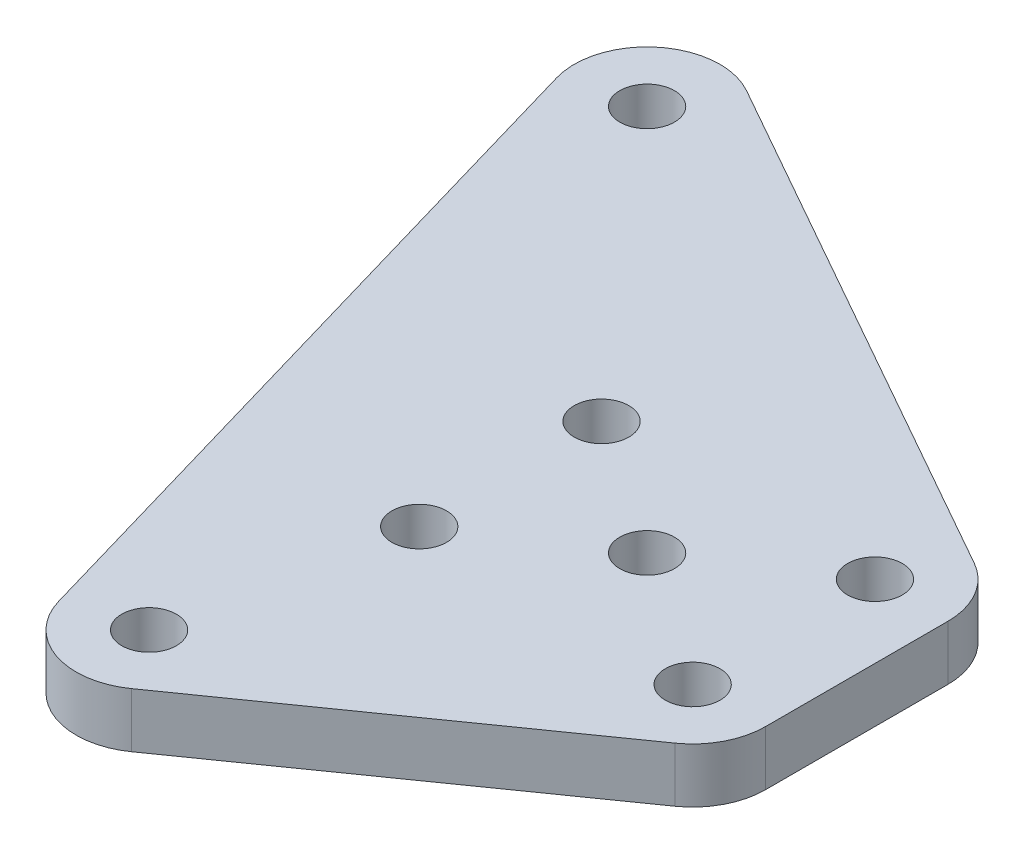
ISO-10303-21;
HEADER;
FILE_DESCRIPTION(('STEP AP214'),'2;1');
FILE_NAME('part.step','',(''),(''),'','','');
FILE_SCHEMA(('AUTOMOTIVE_DESIGN { 1 0 10303 214 1 1 1 1 }'));
ENDSEC;
DATA;
#1=APPLICATION_CONTEXT('core data for automotive mechanical design processes');
#2=APPLICATION_PROTOCOL_DEFINITION('international standard','automotive_design',2000,#1);
#3=PRODUCT_CONTEXT('',#1,'mechanical');
#4=PRODUCT('Part','Part','',(#3));
#5=PRODUCT_RELATED_PRODUCT_CATEGORY('part','',(#4));
#6=PRODUCT_DEFINITION_FORMATION('','',#4);
#7=PRODUCT_DEFINITION_CONTEXT('part definition',#1,'design');
#8=PRODUCT_DEFINITION('design','',#6,#7);
#9=PRODUCT_DEFINITION_SHAPE('','',#8);
#10=(LENGTH_UNIT() NAMED_UNIT(*) SI_UNIT(.MILLI.,.METRE.));
#11=(NAMED_UNIT(*) PLANE_ANGLE_UNIT() SI_UNIT($,.RADIAN.));
#12=(NAMED_UNIT(*) SI_UNIT($,.STERADIAN.) SOLID_ANGLE_UNIT());
#13=UNCERTAINTY_MEASURE_WITH_UNIT(LENGTH_MEASURE(1.E-05),#10,'distance_accuracy_value','');
#14=(GEOMETRIC_REPRESENTATION_CONTEXT(3) GLOBAL_UNCERTAINTY_ASSIGNED_CONTEXT((#13)) GLOBAL_UNIT_ASSIGNED_CONTEXT((#10,
#11,#12)) REPRESENTATION_CONTEXT('',''));
#15=CARTESIAN_POINT('',(0.,0.,0.));
#16=DIRECTION('',(0.,0.,1.));
#17=DIRECTION('',(1.,0.,0.));
#18=AXIS2_PLACEMENT_3D('',#15,#16,#17);
#19=CARTESIAN_POINT('',(-3.14339828220221,3.,19.2668557556427));
#20=DIRECTION('',(0.,1.,0.));
#21=DIRECTION('',(0.,0.,1.));
#22=AXIS2_PLACEMENT_3D('',#19,#20,#21);
#23=PLANE('',#22);
#24=CARTESIAN_POINT('',(-0.643398282201876,3.,-3.05365232004602));
#25=DIRECTION('',(0.,1.,0.));
#26=DIRECTION('',(0.,0.,1.));
#27=AXIS2_PLACEMENT_3D('',#24,#25,#26);
#28=CIRCLE('',#27,1.5);
#29=CARTESIAN_POINT('',(-0.643398282201876,3.,-1.55365232004602));
#30=VERTEX_POINT('',#29);
#31=EDGE_CURVE('E251',#30,#30,#28,.T.);
#32=ORIENTED_EDGE('',*,*,#31,.F.);
#33=EDGE_LOOP('',(#32));
#34=FACE_BOUND('',#33,.T.);
#35=CARTESIAN_POINT('',(-3.14339828220221,3.,19.2668557556427));
#36=DIRECTION('',(0.,1.,0.));
#37=DIRECTION('',(0.,0.,1.));
#38=AXIS2_PLACEMENT_3D('',#35,#36,#37);
#39=CIRCLE('',#38,1.5);
#40=CARTESIAN_POINT('',(-3.14339828220221,3.,20.7668557556427));
#41=VERTEX_POINT('',#40);
#42=EDGE_CURVE('E235',#41,#41,#39,.T.);
#43=ORIENTED_EDGE('',*,*,#42,.F.);
#44=EDGE_LOOP('',(#43));
#45=FACE_BOUND('',#44,.T.);
#46=CARTESIAN_POINT('',(14.3566017177981,3.,-3.05365232004579));
#47=DIRECTION('',(0.,1.,0.));
#48=DIRECTION('',(0.,0.,1.));
#49=AXIS2_PLACEMENT_3D('',#46,#47,#48);
#50=CIRCLE('',#49,1.5);
#51=CARTESIAN_POINT('',(14.3566017177981,3.,-1.5536523200458));
#52=VERTEX_POINT('',#51);
#53=EDGE_CURVE('E219',#52,#52,#50,.T.);
#54=ORIENTED_EDGE('',*,*,#53,.F.);
#55=EDGE_LOOP('',(#54));
#56=FACE_BOUND('',#55,.T.);
#57=CARTESIAN_POINT('',(-3.14339828220221,3.,19.2668557556427));
#58=DIRECTION('',(0.,1.,0.));
#59=DIRECTION('',(0.,0.,1.));
#60=AXIS2_PLACEMENT_3D('',#57,#58,#59);
#61=CIRCLE('',#60,3.99999999999997);
#62=CARTESIAN_POINT('',(-6.98408865920933,3.,20.3844860290179));
#63=VERTEX_POINT('',#62);
#64=CARTESIAN_POINT('',(-0.840713059327286,3.,22.5375805628305));
#65=VERTEX_POINT('',#64);
#66=EDGE_CURVE('E170',#63,#65,#61,.T.);
#67=ORIENTED_EDGE('',*,*,#66,.T.);
#68=DIRECTION('',(0.817681201796942,0.,-0.575671305718731));
#69=VECTOR('',#68,1.);
#70=CARTESIAN_POINT('',(-0.840713059327286,3.,22.5375805628305));
#71=LINE('',#70,#69);
#72=CARTESIAN_POINT('',(16.6592869406729,3.,10.217072487142));
#73=VERTEX_POINT('',#72);
#74=EDGE_CURVE('E106',#65,#73,#71,.T.);
#75=ORIENTED_EDGE('',*,*,#74,.T.);
#76=CARTESIAN_POINT('',(14.356601717798,3.,6.94634767995421));
#77=DIRECTION('',(0.,1.,0.));
#78=DIRECTION('',(0.,0.,1.));
#79=AXIS2_PLACEMENT_3D('',#76,#77,#78);
#80=CIRCLE('',#79,4.);
#81=CARTESIAN_POINT('',(18.356601717798,3.,6.94634767995426));
#82=VERTEX_POINT('',#81);
#83=EDGE_CURVE('E191',#73,#82,#80,.T.);
#84=ORIENTED_EDGE('',*,*,#83,.T.);
#85=DIRECTION('',(0.,0.,-1.));
#86=VECTOR('',#85,1.);
#87=CARTESIAN_POINT('',(18.356601717798,3.,6.94634767995426));
#88=LINE('',#87,#86);
#89=CARTESIAN_POINT('',(18.3566017177981,3.,-3.05365232004574));
#90=VERTEX_POINT('',#89);
#91=EDGE_CURVE('E205',#82,#90,#88,.T.);
#92=ORIENTED_EDGE('',*,*,#91,.T.);
#93=CARTESIAN_POINT('',(14.3566017177981,3.,-3.05365232004579));
#94=DIRECTION('',(0.,1.,0.));
#95=DIRECTION('',(0.,0.,1.));
#96=AXIS2_PLACEMENT_3D('',#93,#94,#95);
#97=CIRCLE('',#96,4.);
#98=CARTESIAN_POINT('',(16.3233597412571,3.,-6.53673470166697));
#99=VERTEX_POINT('',#98);
#100=EDGE_CURVE('E125',#90,#99,#97,.T.);
#101=ORIENTED_EDGE('',*,*,#100,.T.);
#102=DIRECTION('',(-0.870770595405295,0.,-0.491689505864736));
#103=VECTOR('',#102,1.);
#104=CARTESIAN_POINT('',(16.3233597412571,3.,-6.53673470166697));
#105=LINE('',#104,#103);
#106=CARTESIAN_POINT('',(-12.3898436943391,3.,-22.7499381372639));
#107=VERTEX_POINT('',#106);
#108=EDGE_CURVE('E119',#99,#107,#105,.T.);
#109=ORIENTED_EDGE('',*,*,#108,.T.);
#110=CARTESIAN_POINT('',(-14.356601717798,3.,-19.2668557556426));
#111=DIRECTION('',(0.,1.,0.));
#112=DIRECTION('',(0.,0.,1.));
#113=AXIS2_PLACEMENT_3D('',#110,#111,#112);
#114=CIRCLE('',#113,4.00000000000007);
#115=CARTESIAN_POINT('',(-18.1972920948053,3.,-18.1492254822675));
#116=VERTEX_POINT('',#115);
#117=EDGE_CURVE('E123',#107,#116,#114,.T.);
#118=ORIENTED_EDGE('',*,*,#117,.T.);
#119=DIRECTION('',(0.279407568343787,0.,0.96017259425179));
#120=VECTOR('',#119,1.);
#121=CARTESIAN_POINT('',(-18.1972920948052,3.,-18.1492254822675));
#122=LINE('',#121,#120);
#123=EDGE_CURVE('E63',#116,#63,#122,.T.);
#124=ORIENTED_EDGE('',*,*,#123,.T.);
#125=EDGE_LOOP('',(#67,#75,#84,#92,#101,#109,#118,#124));
#126=FACE_BOUND('',#125,.T.);
#127=CARTESIAN_POINT('',(14.356601717798,3.,6.94634767995421));
#128=DIRECTION('',(0.,1.,0.));
#129=DIRECTION('',(0.,0.,1.));
#130=AXIS2_PLACEMENT_3D('',#127,#128,#129);
#131=CIRCLE('',#130,1.5);
#132=CARTESIAN_POINT('',(14.356601717798,3.,8.44634767995421));
#133=VERTEX_POINT('',#132);
#134=EDGE_CURVE('E152',#133,#133,#131,.T.);
#135=ORIENTED_EDGE('',*,*,#134,.F.);
#136=EDGE_LOOP('',(#135));
#137=FACE_BOUND('',#136,.T.);
#138=CARTESIAN_POINT('',(6.85660171779805,3.,1.94634767995409));
#139=DIRECTION('',(0.,1.,0.));
#140=DIRECTION('',(0.,0.,1.));
#141=AXIS2_PLACEMENT_3D('',#138,#139,#140);
#142=CIRCLE('',#141,1.5);
#143=CARTESIAN_POINT('',(6.85660171779805,3.,3.44634767995409));
#144=VERTEX_POINT('',#143);
#145=EDGE_CURVE('E227',#144,#144,#142,.T.);
#146=ORIENTED_EDGE('',*,*,#145,.F.);
#147=EDGE_LOOP('',(#146));
#148=FACE_BOUND('',#147,.T.);
#149=CARTESIAN_POINT('',(-0.643398282202029,3.,6.94634767995398));
#150=DIRECTION('',(0.,1.,0.));
#151=DIRECTION('',(0.,0.,1.));
#152=AXIS2_PLACEMENT_3D('',#149,#150,#151);
#153=CIRCLE('',#152,1.5);
#154=CARTESIAN_POINT('',(-0.643398282202029,3.,8.44634767995398));
#155=VERTEX_POINT('',#154);
#156=EDGE_CURVE('E243',#155,#155,#153,.T.);
#157=ORIENTED_EDGE('',*,*,#156,.F.);
#158=EDGE_LOOP('',(#157));
#159=FACE_BOUND('',#158,.T.);
#160=CARTESIAN_POINT('',(-14.356601717798,3.,-19.2668557556426));
#161=DIRECTION('',(0.,1.,0.));
#162=DIRECTION('',(0.,0.,1.));
#163=AXIS2_PLACEMENT_3D('',#160,#161,#162);
#164=CIRCLE('',#163,1.5);
#165=CARTESIAN_POINT('',(-14.356601717798,3.,-17.7668557556426));
#166=VERTEX_POINT('',#165);
#167=EDGE_CURVE('E259',#166,#166,#164,.T.);
#168=ORIENTED_EDGE('',*,*,#167,.F.);
#169=EDGE_LOOP('',(#168));
#170=FACE_BOUND('',#169,.T.);
#171=ADVANCED_FACE('F45',(#34,#45,#56,#126,#137,#148,#159,#170),#23,.T.);
#172=CARTESIAN_POINT('',(-3.14339828220221,0.,19.2668557556427));
#173=DIRECTION('',(0.,1.,0.));
#174=DIRECTION('',(0.,0.,1.));
#175=AXIS2_PLACEMENT_3D('',#172,#173,#174);
#176=PLANE('',#175);
#177=CARTESIAN_POINT('',(-3.14339828220221,0.,19.2668557556427));
#178=DIRECTION('',(0.,1.,0.));
#179=DIRECTION('',(0.,0.,1.));
#180=AXIS2_PLACEMENT_3D('',#177,#178,#179);
#181=CIRCLE('',#180,3.99999999999997);
#182=CARTESIAN_POINT('',(-6.98408865920933,0.,20.3844860290179));
#183=VERTEX_POINT('',#182);
#184=CARTESIAN_POINT('',(-0.840713059327286,0.,22.5375805628305));
#185=VERTEX_POINT('',#184);
#186=EDGE_CURVE('E147',#183,#185,#181,.T.);
#187=ORIENTED_EDGE('',*,*,#186,.F.);
#188=DIRECTION('',(0.279407568343787,0.,0.96017259425179));
#189=VECTOR('',#188,1.);
#190=CARTESIAN_POINT('',(-18.1972920948052,0.,-18.1492254822675));
#191=LINE('',#190,#189);
#192=CARTESIAN_POINT('',(-18.1972920948053,0.,-18.1492254822675));
#193=VERTEX_POINT('',#192);
#194=EDGE_CURVE('E98',#193,#183,#191,.T.);
#195=ORIENTED_EDGE('',*,*,#194,.F.);
#196=CARTESIAN_POINT('',(-14.356601717798,0.,-19.2668557556426));
#197=DIRECTION('',(0.,1.,0.));
#198=DIRECTION('',(0.,0.,1.));
#199=AXIS2_PLACEMENT_3D('',#196,#197,#198);
#200=CIRCLE('',#199,4.00000000000007);
#201=CARTESIAN_POINT('',(-12.3898436943391,0.,-22.7499381372639));
#202=VERTEX_POINT('',#201);
#203=EDGE_CURVE('E92',#202,#193,#200,.T.);
#204=ORIENTED_EDGE('',*,*,#203,.F.);
#205=DIRECTION('',(-0.870770595405295,0.,-0.491689505864736));
#206=VECTOR('',#205,1.);
#207=CARTESIAN_POINT('',(16.3233597412571,0.,-6.53673470166697));
#208=LINE('',#207,#206);
#209=CARTESIAN_POINT('',(16.3233597412571,0.,-6.53673470166697));
#210=VERTEX_POINT('',#209);
#211=EDGE_CURVE('E134',#210,#202,#208,.T.);
#212=ORIENTED_EDGE('',*,*,#211,.F.);
#213=CARTESIAN_POINT('',(14.3566017177981,0.,-3.05365232004579));
#214=DIRECTION('',(0.,1.,0.));
#215=DIRECTION('',(0.,0.,1.));
#216=AXIS2_PLACEMENT_3D('',#213,#214,#215);
#217=CIRCLE('',#216,4.);
#218=CARTESIAN_POINT('',(18.3566017177981,0.,-3.05365232004574));
#219=VERTEX_POINT('',#218);
#220=EDGE_CURVE('E161',#219,#210,#217,.T.);
#221=ORIENTED_EDGE('',*,*,#220,.F.);
#222=DIRECTION('',(0.,0.,-1.));
#223=VECTOR('',#222,1.);
#224=CARTESIAN_POINT('',(18.356601717798,0.,6.94634767995426));
#225=LINE('',#224,#223);
#226=CARTESIAN_POINT('',(18.356601717798,0.,6.94634767995426));
#227=VERTEX_POINT('',#226);
#228=EDGE_CURVE('E158',#227,#219,#225,.T.);
#229=ORIENTED_EDGE('',*,*,#228,.F.);
#230=CARTESIAN_POINT('',(14.356601717798,0.,6.94634767995421));
#231=DIRECTION('',(0.,1.,0.));
#232=DIRECTION('',(0.,0.,1.));
#233=AXIS2_PLACEMENT_3D('',#230,#231,#232);
#234=CIRCLE('',#233,4.);
#235=CARTESIAN_POINT('',(16.6592869406729,0.,10.217072487142));
#236=VERTEX_POINT('',#235);
#237=EDGE_CURVE('E155',#236,#227,#234,.T.);
#238=ORIENTED_EDGE('',*,*,#237,.F.);
#239=DIRECTION('',(0.817681201796942,0.,-0.575671305718731));
#240=VECTOR('',#239,1.);
#241=CARTESIAN_POINT('',(-0.840713059327286,0.,22.5375805628305));
#242=LINE('',#241,#240);
#243=EDGE_CURVE('E151',#185,#236,#242,.T.);
#244=ORIENTED_EDGE('',*,*,#243,.F.);
#245=EDGE_LOOP('',(#187,#195,#204,#212,#221,#229,#238,#244));
#246=FACE_BOUND('',#245,.T.);
#247=CARTESIAN_POINT('',(14.356601717798,0.,6.94634767995421));
#248=DIRECTION('',(0.,1.,0.));
#249=DIRECTION('',(0.,0.,1.));
#250=AXIS2_PLACEMENT_3D('',#247,#248,#249);
#251=CIRCLE('',#250,1.5);
#252=CARTESIAN_POINT('',(14.356601717798,0.,8.44634767995421));
#253=VERTEX_POINT('',#252);
#254=EDGE_CURVE('E215',#253,#253,#251,.T.);
#255=ORIENTED_EDGE('',*,*,#254,.T.);
#256=EDGE_LOOP('',(#255));
#257=FACE_BOUND('',#256,.T.);
#258=CARTESIAN_POINT('',(14.3566017177981,0.,-3.05365232004579));
#259=DIRECTION('',(0.,1.,0.));
#260=DIRECTION('',(0.,0.,1.));
#261=AXIS2_PLACEMENT_3D('',#258,#259,#260);
#262=CIRCLE('',#261,1.5);
#263=CARTESIAN_POINT('',(14.3566017177981,0.,-1.5536523200458));
#264=VERTEX_POINT('',#263);
#265=EDGE_CURVE('E223',#264,#264,#262,.T.);
#266=ORIENTED_EDGE('',*,*,#265,.T.);
#267=EDGE_LOOP('',(#266));
#268=FACE_BOUND('',#267,.T.);
#269=CARTESIAN_POINT('',(6.85660171779805,0.,1.94634767995409));
#270=DIRECTION('',(0.,1.,0.));
#271=DIRECTION('',(0.,0.,1.));
#272=AXIS2_PLACEMENT_3D('',#269,#270,#271);
#273=CIRCLE('',#272,1.5);
#274=CARTESIAN_POINT('',(6.85660171779805,0.,3.44634767995409));
#275=VERTEX_POINT('',#274);
#276=EDGE_CURVE('E231',#275,#275,#273,.T.);
#277=ORIENTED_EDGE('',*,*,#276,.T.);
#278=EDGE_LOOP('',(#277));
#279=FACE_BOUND('',#278,.T.);
#280=CARTESIAN_POINT('',(-3.14339828220221,0.,19.2668557556427));
#281=DIRECTION('',(0.,1.,0.));
#282=DIRECTION('',(0.,0.,1.));
#283=AXIS2_PLACEMENT_3D('',#280,#281,#282);
#284=CIRCLE('',#283,1.5);
#285=CARTESIAN_POINT('',(-3.14339828220221,0.,20.7668557556427));
#286=VERTEX_POINT('',#285);
#287=EDGE_CURVE('E239',#286,#286,#284,.T.);
#288=ORIENTED_EDGE('',*,*,#287,.T.);
#289=EDGE_LOOP('',(#288));
#290=FACE_BOUND('',#289,.T.);
#291=CARTESIAN_POINT('',(-0.643398282202029,0.,6.94634767995398));
#292=DIRECTION('',(0.,1.,0.));
#293=DIRECTION('',(0.,0.,1.));
#294=AXIS2_PLACEMENT_3D('',#291,#292,#293);
#295=CIRCLE('',#294,1.5);
#296=CARTESIAN_POINT('',(-0.643398282202029,0.,8.44634767995398));
#297=VERTEX_POINT('',#296);
#298=EDGE_CURVE('E247',#297,#297,#295,.T.);
#299=ORIENTED_EDGE('',*,*,#298,.T.);
#300=EDGE_LOOP('',(#299));
#301=FACE_BOUND('',#300,.T.);
#302=CARTESIAN_POINT('',(-0.643398282201876,0.,-3.05365232004602));
#303=DIRECTION('',(0.,1.,0.));
#304=DIRECTION('',(0.,0.,1.));
#305=AXIS2_PLACEMENT_3D('',#302,#303,#304);
#306=CIRCLE('',#305,1.5);
#307=CARTESIAN_POINT('',(-0.643398282201876,0.,-1.55365232004602));
#308=VERTEX_POINT('',#307);
#309=EDGE_CURVE('E255',#308,#308,#306,.T.);
#310=ORIENTED_EDGE('',*,*,#309,.T.);
#311=EDGE_LOOP('',(#310));
#312=FACE_BOUND('',#311,.T.);
#313=CARTESIAN_POINT('',(-14.356601717798,0.,-19.2668557556426));
#314=DIRECTION('',(0.,1.,0.));
#315=DIRECTION('',(0.,0.,1.));
#316=AXIS2_PLACEMENT_3D('',#313,#314,#315);
#317=CIRCLE('',#316,1.5);
#318=CARTESIAN_POINT('',(-14.356601717798,0.,-17.7668557556426));
#319=VERTEX_POINT('',#318);
#320=EDGE_CURVE('E263',#319,#319,#317,.T.);
#321=ORIENTED_EDGE('',*,*,#320,.T.);
#322=EDGE_LOOP('',(#321));
#323=FACE_BOUND('',#322,.T.);
#324=ADVANCED_FACE('F195',(#246,#257,#268,#279,#290,#301,#312,#323),#176,.F.);
#325=CARTESIAN_POINT('',(-3.14339828220221,3.,19.2668557556427));
#326=DIRECTION('',(0.,-1.,0.));
#327=DIRECTION('',(0.,0.,-1.));
#328=AXIS2_PLACEMENT_3D('',#325,#326,#327);
#329=CYLINDRICAL_SURFACE('',#328,3.99999999999997);
#330=ORIENTED_EDGE('',*,*,#186,.T.);
#331=DIRECTION('',(0.,-1.,0.));
#332=VECTOR('',#331,1.);
#333=CARTESIAN_POINT('',(-0.840713059327286,3.,22.5375805628305));
#334=LINE('',#333,#332);
#335=EDGE_CURVE('E11',#65,#185,#334,.T.);
#336=ORIENTED_EDGE('',*,*,#335,.F.);
#337=ORIENTED_EDGE('',*,*,#66,.F.);
#338=DIRECTION('',(0.,-1.,0.));
#339=VECTOR('',#338,1.);
#340=CARTESIAN_POINT('',(-6.98408865920933,3.,20.3844860290179));
#341=LINE('',#340,#339);
#342=EDGE_CURVE('E143',#63,#183,#341,.T.);
#343=ORIENTED_EDGE('',*,*,#342,.T.);
#344=EDGE_LOOP('',(#330,#336,#337,#343));
#345=FACE_BOUND('',#344,.T.);
#346=ADVANCED_FACE('F47',(#345),#329,.T.);
#347=CARTESIAN_POINT('',(-0.840713059327286,3.,22.5375805628305));
#348=DIRECTION('',(-0.575671305718731,0.,-0.817681201796942));
#349=DIRECTION('',(-0.817681201796942,0.,0.575671305718731));
#350=AXIS2_PLACEMENT_3D('',#347,#348,#349);
#351=PLANE('',#350);
#352=ORIENTED_EDGE('',*,*,#243,.T.);
#353=DIRECTION('',(0.,-1.,0.));
#354=VECTOR('',#353,1.);
#355=CARTESIAN_POINT('',(16.6592869406729,3.,10.217072487142));
#356=LINE('',#355,#354);
#357=EDGE_CURVE('E55',#73,#236,#356,.T.);
#358=ORIENTED_EDGE('',*,*,#357,.F.);
#359=ORIENTED_EDGE('',*,*,#74,.F.);
#360=ORIENTED_EDGE('',*,*,#335,.T.);
#361=EDGE_LOOP('',(#352,#358,#359,#360));
#362=FACE_BOUND('',#361,.T.);
#363=ADVANCED_FACE('F299',(#362),#351,.F.);
#364=CARTESIAN_POINT('',(14.356601717798,3.,6.94634767995421));
#365=DIRECTION('',(0.,-1.,0.));
#366=DIRECTION('',(0.,0.,-1.));
#367=AXIS2_PLACEMENT_3D('',#364,#365,#366);
#368=CYLINDRICAL_SURFACE('',#367,4.);
#369=ORIENTED_EDGE('',*,*,#237,.T.);
#370=DIRECTION('',(0.,-1.,0.));
#371=VECTOR('',#370,1.);
#372=CARTESIAN_POINT('',(18.356601717798,3.,6.94634767995426));
#373=LINE('',#372,#371);
#374=EDGE_CURVE('E181',#82,#227,#373,.T.);
#375=ORIENTED_EDGE('',*,*,#374,.F.);
#376=ORIENTED_EDGE('',*,*,#83,.F.);
#377=ORIENTED_EDGE('',*,*,#357,.T.);
#378=EDGE_LOOP('',(#369,#375,#376,#377));
#379=FACE_BOUND('',#378,.T.);
#380=ADVANCED_FACE('F189',(#379),#368,.T.);
#381=CARTESIAN_POINT('',(18.356601717798,3.,6.94634767995426));
#382=DIRECTION('',(-1.,0.,0.));
#383=DIRECTION('',(0.,0.,1.));
#384=AXIS2_PLACEMENT_3D('',#381,#382,#383);
#385=PLANE('',#384);
#386=ORIENTED_EDGE('',*,*,#228,.T.);
#387=DIRECTION('',(0.,-1.,0.));
#388=VECTOR('',#387,1.);
#389=CARTESIAN_POINT('',(18.3566017177981,3.,-3.05365232004574));
#390=LINE('',#389,#388);
#391=EDGE_CURVE('E177',#90,#219,#390,.T.);
#392=ORIENTED_EDGE('',*,*,#391,.F.);
#393=ORIENTED_EDGE('',*,*,#91,.F.);
#394=ORIENTED_EDGE('',*,*,#374,.T.);
#395=EDGE_LOOP('',(#386,#392,#393,#394));
#396=FACE_BOUND('',#395,.T.);
#397=ADVANCED_FACE('F200',(#396),#385,.F.);
#398=CARTESIAN_POINT('',(14.3566017177981,3.,-3.05365232004579));
#399=DIRECTION('',(0.,-1.,0.));
#400=DIRECTION('',(0.,0.,-1.));
#401=AXIS2_PLACEMENT_3D('',#398,#399,#400);
#402=CYLINDRICAL_SURFACE('',#401,4.);
#403=ORIENTED_EDGE('',*,*,#220,.T.);
#404=DIRECTION('',(0.,-1.,0.));
#405=VECTOR('',#404,1.);
#406=CARTESIAN_POINT('',(16.3233597412571,3.,-6.53673470166697));
#407=LINE('',#406,#405);
#408=EDGE_CURVE('E136',#99,#210,#407,.T.);
#409=ORIENTED_EDGE('',*,*,#408,.F.);
#410=ORIENTED_EDGE('',*,*,#100,.F.);
#411=ORIENTED_EDGE('',*,*,#391,.T.);
#412=EDGE_LOOP('',(#403,#409,#410,#411));
#413=FACE_BOUND('',#412,.T.);
#414=ADVANCED_FACE('F203',(#413),#402,.T.);
#415=CARTESIAN_POINT('',(16.3233597412571,3.,-6.53673470166697));
#416=DIRECTION('',(-0.491689505864736,0.,0.870770595405295));
#417=DIRECTION('',(0.870770595405295,0.,0.491689505864736));
#418=AXIS2_PLACEMENT_3D('',#415,#416,#417);
#419=PLANE('',#418);
#420=ORIENTED_EDGE('',*,*,#211,.T.);
#421=DIRECTION('',(0.,-1.,0.));
#422=VECTOR('',#421,1.);
#423=CARTESIAN_POINT('',(-12.3898436943391,3.,-22.7499381372639));
#424=LINE('',#423,#422);
#425=EDGE_CURVE('E131',#107,#202,#424,.T.);
#426=ORIENTED_EDGE('',*,*,#425,.F.);
#427=ORIENTED_EDGE('',*,*,#108,.F.);
#428=ORIENTED_EDGE('',*,*,#408,.T.);
#429=EDGE_LOOP('',(#420,#426,#427,#428));
#430=FACE_BOUND('',#429,.T.);
#431=ADVANCED_FACE('F132',(#430),#419,.F.);
#432=CARTESIAN_POINT('',(-14.356601717798,3.,-19.2668557556426));
#433=DIRECTION('',(0.,-1.,0.));
#434=DIRECTION('',(0.,0.,-1.));
#435=AXIS2_PLACEMENT_3D('',#432,#433,#434);
#436=CYLINDRICAL_SURFACE('',#435,4.00000000000007);
#437=ORIENTED_EDGE('',*,*,#203,.T.);
#438=DIRECTION('',(0.,-1.,0.));
#439=VECTOR('',#438,1.);
#440=CARTESIAN_POINT('',(-18.1972920948053,3.,-18.1492254822675));
#441=LINE('',#440,#439);
#442=EDGE_CURVE('E137',#116,#193,#441,.T.);
#443=ORIENTED_EDGE('',*,*,#442,.F.);
#444=ORIENTED_EDGE('',*,*,#117,.F.);
#445=ORIENTED_EDGE('',*,*,#425,.T.);
#446=EDGE_LOOP('',(#437,#443,#444,#445));
#447=FACE_BOUND('',#446,.T.);
#448=ADVANCED_FACE('F139',(#447),#436,.T.);
#449=CARTESIAN_POINT('',(-18.1972920948052,3.,-18.1492254822675));
#450=DIRECTION('',(0.96017259425179,0.,-0.279407568343787));
#451=DIRECTION('',(-0.279407568343787,0.,-0.96017259425179));
#452=AXIS2_PLACEMENT_3D('',#449,#450,#451);
#453=PLANE('',#452);
#454=ORIENTED_EDGE('',*,*,#194,.T.);
#455=ORIENTED_EDGE('',*,*,#342,.F.);
#456=ORIENTED_EDGE('',*,*,#123,.F.);
#457=ORIENTED_EDGE('',*,*,#442,.T.);
#458=EDGE_LOOP('',(#454,#455,#456,#457));
#459=FACE_BOUND('',#458,.T.);
#460=ADVANCED_FACE('F287',(#459),#453,.F.);
#461=CARTESIAN_POINT('',(14.356601717798,3.,6.94634767995421));
#462=DIRECTION('',(0.,-1.,0.));
#463=DIRECTION('',(0.,0.,-1.));
#464=AXIS2_PLACEMENT_3D('',#461,#462,#463);
#465=CYLINDRICAL_SURFACE('',#464,1.5);
#466=ORIENTED_EDGE('',*,*,#134,.T.);
#467=EDGE_LOOP('',(#466));
#468=FACE_BOUND('',#467,.T.);
#469=ORIENTED_EDGE('',*,*,#254,.F.);
#470=EDGE_LOOP('',(#469));
#471=FACE_BOUND('',#470,.T.);
#472=ADVANCED_FACE('F284',(#468,#471),#465,.F.);
#473=CARTESIAN_POINT('',(14.3566017177981,3.,-3.05365232004579));
#474=DIRECTION('',(0.,-1.,0.));
#475=DIRECTION('',(0.,0.,-1.));
#476=AXIS2_PLACEMENT_3D('',#473,#474,#475);
#477=CYLINDRICAL_SURFACE('',#476,1.5);
#478=ORIENTED_EDGE('',*,*,#53,.T.);
#479=EDGE_LOOP('',(#478));
#480=FACE_BOUND('',#479,.T.);
#481=ORIENTED_EDGE('',*,*,#265,.F.);
#482=EDGE_LOOP('',(#481));
#483=FACE_BOUND('',#482,.T.);
#484=ADVANCED_FACE('F362',(#480,#483),#477,.F.);
#485=CARTESIAN_POINT('',(6.85660171779805,3.,1.94634767995409));
#486=DIRECTION('',(0.,-1.,0.));
#487=DIRECTION('',(0.,0.,-1.));
#488=AXIS2_PLACEMENT_3D('',#485,#486,#487);
#489=CYLINDRICAL_SURFACE('',#488,1.5);
#490=ORIENTED_EDGE('',*,*,#145,.T.);
#491=EDGE_LOOP('',(#490));
#492=FACE_BOUND('',#491,.T.);
#493=ORIENTED_EDGE('',*,*,#276,.F.);
#494=EDGE_LOOP('',(#493));
#495=FACE_BOUND('',#494,.T.);
#496=ADVANCED_FACE('F370',(#492,#495),#489,.F.);
#497=CARTESIAN_POINT('',(-3.14339828220221,3.,19.2668557556427));
#498=DIRECTION('',(0.,-1.,0.));
#499=DIRECTION('',(0.,0.,-1.));
#500=AXIS2_PLACEMENT_3D('',#497,#498,#499);
#501=CYLINDRICAL_SURFACE('',#500,1.5);
#502=ORIENTED_EDGE('',*,*,#42,.T.);
#503=EDGE_LOOP('',(#502));
#504=FACE_BOUND('',#503,.T.);
#505=ORIENTED_EDGE('',*,*,#287,.F.);
#506=EDGE_LOOP('',(#505));
#507=FACE_BOUND('',#506,.T.);
#508=ADVANCED_FACE('F378',(#504,#507),#501,.F.);
#509=CARTESIAN_POINT('',(-0.643398282202029,3.,6.94634767995398));
#510=DIRECTION('',(0.,-1.,0.));
#511=DIRECTION('',(0.,0.,-1.));
#512=AXIS2_PLACEMENT_3D('',#509,#510,#511);
#513=CYLINDRICAL_SURFACE('',#512,1.5);
#514=ORIENTED_EDGE('',*,*,#156,.T.);
#515=EDGE_LOOP('',(#514));
#516=FACE_BOUND('',#515,.T.);
#517=ORIENTED_EDGE('',*,*,#298,.F.);
#518=EDGE_LOOP('',(#517));
#519=FACE_BOUND('',#518,.T.);
#520=ADVANCED_FACE('F387',(#516,#519),#513,.F.);
#521=CARTESIAN_POINT('',(-0.643398282201876,3.,-3.05365232004602));
#522=DIRECTION('',(0.,-1.,0.));
#523=DIRECTION('',(0.,0.,-1.));
#524=AXIS2_PLACEMENT_3D('',#521,#522,#523);
#525=CYLINDRICAL_SURFACE('',#524,1.5);
#526=ORIENTED_EDGE('',*,*,#31,.T.);
#527=EDGE_LOOP('',(#526));
#528=FACE_BOUND('',#527,.T.);
#529=ORIENTED_EDGE('',*,*,#309,.F.);
#530=EDGE_LOOP('',(#529));
#531=FACE_BOUND('',#530,.T.);
#532=ADVANCED_FACE('F396',(#528,#531),#525,.F.);
#533=CARTESIAN_POINT('',(-14.356601717798,3.,-19.2668557556426));
#534=DIRECTION('',(0.,-1.,0.));
#535=DIRECTION('',(0.,0.,-1.));
#536=AXIS2_PLACEMENT_3D('',#533,#534,#535);
#537=CYLINDRICAL_SURFACE('',#536,1.5);
#538=ORIENTED_EDGE('',*,*,#167,.T.);
#539=EDGE_LOOP('',(#538));
#540=FACE_BOUND('',#539,.T.);
#541=ORIENTED_EDGE('',*,*,#320,.F.);
#542=EDGE_LOOP('',(#541));
#543=FACE_BOUND('',#542,.T.);
#544=ADVANCED_FACE('F271',(#540,#543),#537,.F.);
#545=CLOSED_SHELL('',(#171,#324,#346,#363,#380,#397,#414,#431,#448,#460,#472,#484,#496,#508,
#520,#532,#544));
#546=MANIFOLD_SOLID_BREP('B2',#545);
#547=ADVANCED_BREP_SHAPE_REPRESENTATION('',(#18,#546),#14);
#548=SHAPE_DEFINITION_REPRESENTATION(#9,#547);
ENDSEC;
END-ISO-10303-21;
